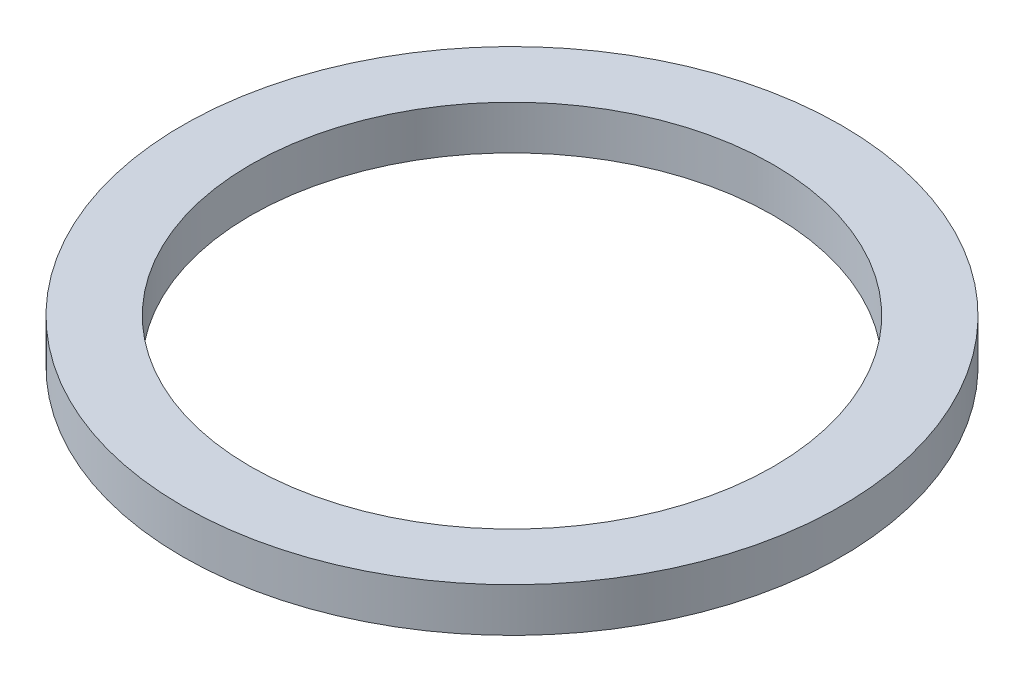
ISO-10303-21;
HEADER;
FILE_DESCRIPTION(('STEP AP214'),'2;1');
FILE_NAME('part.step','',(''),(''),'','','');
FILE_SCHEMA(('AUTOMOTIVE_DESIGN { 1 0 10303 214 1 1 1 1 }'));
ENDSEC;
DATA;
#1=APPLICATION_CONTEXT('core data for automotive mechanical design processes');
#2=APPLICATION_PROTOCOL_DEFINITION('international standard','automotive_design',2000,#1);
#3=PRODUCT_CONTEXT('',#1,'mechanical');
#4=PRODUCT('Part','Part','',(#3));
#5=PRODUCT_RELATED_PRODUCT_CATEGORY('part','',(#4));
#6=PRODUCT_DEFINITION_FORMATION('','',#4);
#7=PRODUCT_DEFINITION_CONTEXT('part definition',#1,'design');
#8=PRODUCT_DEFINITION('design','',#6,#7);
#9=PRODUCT_DEFINITION_SHAPE('','',#8);
#10=(LENGTH_UNIT() NAMED_UNIT(*) SI_UNIT(.MILLI.,.METRE.));
#11=(NAMED_UNIT(*) PLANE_ANGLE_UNIT() SI_UNIT($,.RADIAN.));
#12=(NAMED_UNIT(*) SI_UNIT($,.STERADIAN.) SOLID_ANGLE_UNIT());
#13=UNCERTAINTY_MEASURE_WITH_UNIT(LENGTH_MEASURE(1.E-05),#10,'distance_accuracy_value','');
#14=(GEOMETRIC_REPRESENTATION_CONTEXT(3) GLOBAL_UNCERTAINTY_ASSIGNED_CONTEXT((#13)) GLOBAL_UNIT_ASSIGNED_CONTEXT((#10,
#11,#12)) REPRESENTATION_CONTEXT('',''));
#15=CARTESIAN_POINT('',(0.,0.,0.));
#16=DIRECTION('',(0.,0.,1.));
#17=DIRECTION('',(1.,0.,0.));
#18=AXIS2_PLACEMENT_3D('',#15,#16,#17);
#19=CARTESIAN_POINT('',(0.,1.,0.));
#20=DIRECTION('',(0.,1.,0.));
#21=DIRECTION('',(0.,0.,1.));
#22=AXIS2_PLACEMENT_3D('',#19,#20,#21);
#23=PLANE('',#22);
#24=CARTESIAN_POINT('',(0.,1.,0.));
#25=DIRECTION('',(0.,1.,0.));
#26=DIRECTION('',(0.,0.,1.));
#27=AXIS2_PLACEMENT_3D('',#24,#25,#26);
#28=CIRCLE('',#27,7.5);
#29=CARTESIAN_POINT('',(0.,1.,7.5));
#30=VERTEX_POINT('',#29);
#31=EDGE_CURVE('E10',#30,#30,#28,.T.);
#32=ORIENTED_EDGE('',*,*,#31,.T.);
#33=EDGE_LOOP('',(#32));
#34=FACE_BOUND('',#33,.T.);
#35=CARTESIAN_POINT('',(0.,1.,0.));
#36=DIRECTION('',(0.,1.,0.));
#37=DIRECTION('',(0.,0.,1.));
#38=AXIS2_PLACEMENT_3D('',#35,#36,#37);
#39=CIRCLE('',#38,5.95);
#40=CARTESIAN_POINT('',(0.,1.,5.95));
#41=VERTEX_POINT('',#40);
#42=EDGE_CURVE('E47',#41,#41,#39,.T.);
#43=ORIENTED_EDGE('',*,*,#42,.F.);
#44=EDGE_LOOP('',(#43));
#45=FACE_BOUND('',#44,.T.);
#46=ADVANCED_FACE('F36',(#34,#45),#23,.T.);
#47=CARTESIAN_POINT('',(0.,0.,0.));
#48=DIRECTION('',(0.,1.,0.));
#49=DIRECTION('',(0.,0.,1.));
#50=AXIS2_PLACEMENT_3D('',#47,#48,#49);
#51=PLANE('',#50);
#52=CARTESIAN_POINT('',(0.,0.,0.));
#53=DIRECTION('',(0.,1.,0.));
#54=DIRECTION('',(0.,0.,1.));
#55=AXIS2_PLACEMENT_3D('',#52,#53,#54);
#56=CIRCLE('',#55,7.5);
#57=CARTESIAN_POINT('',(0.,0.,7.5));
#58=VERTEX_POINT('',#57);
#59=EDGE_CURVE('E40',#58,#58,#56,.T.);
#60=ORIENTED_EDGE('',*,*,#59,.F.);
#61=EDGE_LOOP('',(#60));
#62=FACE_BOUND('',#61,.T.);
#63=CARTESIAN_POINT('',(0.,0.,0.));
#64=DIRECTION('',(0.,1.,0.));
#65=DIRECTION('',(0.,0.,1.));
#66=AXIS2_PLACEMENT_3D('',#63,#64,#65);
#67=CIRCLE('',#66,5.95);
#68=CARTESIAN_POINT('',(0.,0.,5.95));
#69=VERTEX_POINT('',#68);
#70=EDGE_CURVE('E49',#69,#69,#67,.T.);
#71=ORIENTED_EDGE('',*,*,#70,.T.);
#72=EDGE_LOOP('',(#71));
#73=FACE_BOUND('',#72,.T.);
#74=ADVANCED_FACE('F59',(#62,#73),#51,.F.);
#75=CARTESIAN_POINT('',(0.,1.,0.));
#76=DIRECTION('',(0.,-1.,0.));
#77=DIRECTION('',(0.,0.,-1.));
#78=AXIS2_PLACEMENT_3D('',#75,#76,#77);
#79=CYLINDRICAL_SURFACE('',#78,7.5);
#80=ORIENTED_EDGE('',*,*,#31,.F.);
#81=EDGE_LOOP('',(#80));
#82=FACE_BOUND('',#81,.T.);
#83=ORIENTED_EDGE('',*,*,#59,.T.);
#84=EDGE_LOOP('',(#83));
#85=FACE_BOUND('',#84,.T.);
#86=ADVANCED_FACE('F38',(#82,#85),#79,.T.);
#87=CARTESIAN_POINT('',(0.,1.,0.));
#88=DIRECTION('',(0.,-1.,0.));
#89=DIRECTION('',(0.,0.,-1.));
#90=AXIS2_PLACEMENT_3D('',#87,#88,#89);
#91=CYLINDRICAL_SURFACE('',#90,5.95);
#92=ORIENTED_EDGE('',*,*,#42,.T.);
#93=EDGE_LOOP('',(#92));
#94=FACE_BOUND('',#93,.T.);
#95=ORIENTED_EDGE('',*,*,#70,.F.);
#96=EDGE_LOOP('',(#95));
#97=FACE_BOUND('',#96,.T.);
#98=ADVANCED_FACE('F55',(#94,#97),#91,.F.);
#99=CLOSED_SHELL('',(#46,#74,#86,#98));
#100=MANIFOLD_SOLID_BREP('B2',#99);
#101=ADVANCED_BREP_SHAPE_REPRESENTATION('',(#18,#100),#14);
#102=SHAPE_DEFINITION_REPRESENTATION(#9,#101);
ENDSEC;
END-ISO-10303-21;
